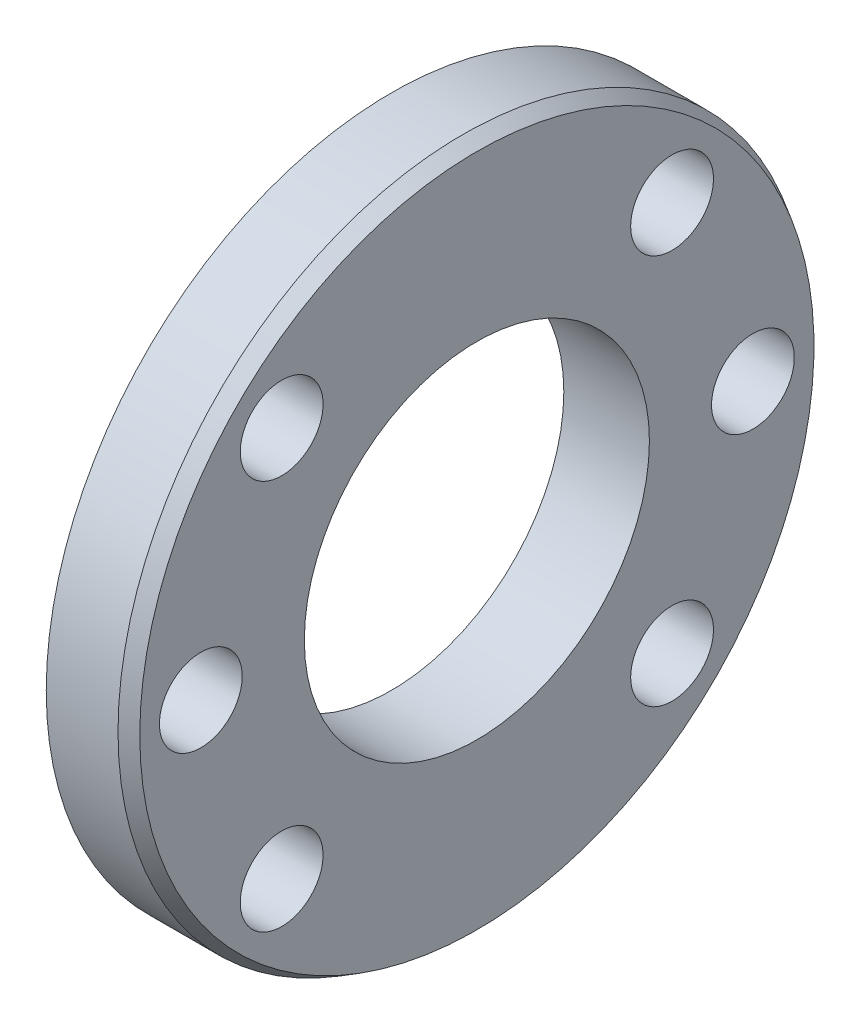
ISO-10303-21;
HEADER;
FILE_DESCRIPTION(('STEP AP214'),'2;1');
FILE_NAME('part.step','',(''),(''),'','','');
FILE_SCHEMA(('AUTOMOTIVE_DESIGN { 1 0 10303 214 1 1 1 1 }'));
ENDSEC;
DATA;
#1=APPLICATION_CONTEXT('core data for automotive mechanical design processes');
#2=APPLICATION_PROTOCOL_DEFINITION('international standard','automotive_design',2000,#1);
#3=PRODUCT_CONTEXT('',#1,'mechanical');
#4=PRODUCT('Part','Part','',(#3));
#5=PRODUCT_RELATED_PRODUCT_CATEGORY('part','',(#4));
#6=PRODUCT_DEFINITION_FORMATION('','',#4);
#7=PRODUCT_DEFINITION_CONTEXT('part definition',#1,'design');
#8=PRODUCT_DEFINITION('design','',#6,#7);
#9=PRODUCT_DEFINITION_SHAPE('','',#8);
#10=(LENGTH_UNIT() NAMED_UNIT(*) SI_UNIT(.MILLI.,.METRE.));
#11=(NAMED_UNIT(*) PLANE_ANGLE_UNIT() SI_UNIT($,.RADIAN.));
#12=(NAMED_UNIT(*) SI_UNIT($,.STERADIAN.) SOLID_ANGLE_UNIT());
#13=UNCERTAINTY_MEASURE_WITH_UNIT(LENGTH_MEASURE(1.E-05),#10,'distance_accuracy_value','');
#14=(GEOMETRIC_REPRESENTATION_CONTEXT(3) GLOBAL_UNCERTAINTY_ASSIGNED_CONTEXT((#13)) GLOBAL_UNIT_ASSIGNED_CONTEXT((#10,
#11,#12)) REPRESENTATION_CONTEXT('',''));
#15=CARTESIAN_POINT('',(0.,0.,0.));
#16=DIRECTION('',(0.,0.,1.));
#17=DIRECTION('',(1.,0.,0.));
#18=AXIS2_PLACEMENT_3D('',#15,#16,#17);
#19=CARTESIAN_POINT('',(1045.,0.,1320.));
#20=DIRECTION('',(-1.,0.,0.));
#21=DIRECTION('',(0.,0.,-1.));
#22=AXIS2_PLACEMENT_3D('',#19,#20,#21);
#23=CYLINDRICAL_SURFACE('',#22,12.5);
#24=CARTESIAN_POINT('',(1038.8,0.,1320.));
#25=DIRECTION('',(1.,0.,0.));
#26=DIRECTION('',(0.,0.,1.));
#27=AXIS2_PLACEMENT_3D('',#24,#25,#26);
#28=CIRCLE('',#27,12.5);
#29=CARTESIAN_POINT('',(1038.8,0.,1332.5));
#30=VERTEX_POINT('',#29);
#31=EDGE_CURVE('E22',#30,#30,#28,.T.);
#32=ORIENTED_EDGE('',*,*,#31,.F.);
#33=EDGE_LOOP('',(#32));
#34=FACE_BOUND('',#33,.T.);
#35=CARTESIAN_POINT('',(1045.,0.,1320.));
#36=DIRECTION('',(-1.,0.,0.));
#37=DIRECTION('',(0.,0.,-1.));
#38=AXIS2_PLACEMENT_3D('',#35,#36,#37);
#39=CIRCLE('',#38,12.5);
#40=CARTESIAN_POINT('',(1045.,0.,1307.5));
#41=VERTEX_POINT('',#40);
#42=EDGE_CURVE('E36',#41,#41,#39,.T.);
#43=ORIENTED_EDGE('',*,*,#42,.F.);
#44=EDGE_LOOP('',(#43));
#45=FACE_BOUND('',#44,.T.);
#46=ADVANCED_FACE('F14',(#34,#45),#23,.F.);
#47=CARTESIAN_POINT('',(1045.,0.,1340.));
#48=DIRECTION('',(-1.,0.,0.));
#49=DIRECTION('',(0.,0.,-1.));
#50=AXIS2_PLACEMENT_3D('',#47,#48,#49);
#51=CYLINDRICAL_SURFACE('',#50,3.);
#52=CARTESIAN_POINT('',(1038.8,0.,1340.));
#53=DIRECTION('',(1.,0.,0.));
#54=DIRECTION('',(0.,0.,1.));
#55=AXIS2_PLACEMENT_3D('',#52,#53,#54);
#56=CIRCLE('',#55,3.);
#57=CARTESIAN_POINT('',(1038.8,0.,1343.));
#58=VERTEX_POINT('',#57);
#59=EDGE_CURVE('E27',#58,#58,#56,.T.);
#60=ORIENTED_EDGE('',*,*,#59,.F.);
#61=EDGE_LOOP('',(#60));
#62=FACE_BOUND('',#61,.T.);
#63=CARTESIAN_POINT('',(1045.,0.,1340.));
#64=DIRECTION('',(-1.,0.,0.));
#65=DIRECTION('',(0.,0.,-1.));
#66=AXIS2_PLACEMENT_3D('',#63,#64,#65);
#67=CIRCLE('',#66,3.);
#68=CARTESIAN_POINT('',(1045.,0.,1337.));
#69=VERTEX_POINT('',#68);
#70=EDGE_CURVE('E33',#69,#69,#67,.T.);
#71=ORIENTED_EDGE('',*,*,#70,.F.);
#72=EDGE_LOOP('',(#71));
#73=FACE_BOUND('',#72,.T.);
#74=ADVANCED_FACE('F98',(#62,#73),#51,.F.);
#75=CARTESIAN_POINT('',(1045.,0.,1320.));
#76=DIRECTION('',(1.,0.,0.));
#77=DIRECTION('',(0.,0.,1.));
#78=AXIS2_PLACEMENT_3D('',#75,#76,#77);
#79=PLANE('',#78);
#80=CARTESIAN_POINT('',(1045.,-14.1421356237309,1305.85786437627));
#81=DIRECTION('',(-1.,0.,0.));
#82=DIRECTION('',(0.,0.,1.));
#83=AXIS2_PLACEMENT_3D('',#80,#81,#82);
#84=CIRCLE('',#83,3.);
#85=CARTESIAN_POINT('',(1045.,-14.1421356237309,1308.85786437627));
#86=VERTEX_POINT('',#85);
#87=EDGE_CURVE('E69',#86,#86,#84,.T.);
#88=ORIENTED_EDGE('',*,*,#87,.T.);
#89=EDGE_LOOP('',(#88));
#90=FACE_BOUND('',#89,.T.);
#91=CARTESIAN_POINT('',(1045.,0.,1300.));
#92=DIRECTION('',(-1.,0.,0.));
#93=DIRECTION('',(0.,0.,1.));
#94=AXIS2_PLACEMENT_3D('',#91,#92,#93);
#95=CIRCLE('',#94,3.);
#96=CARTESIAN_POINT('',(1045.,0.,1303.));
#97=VERTEX_POINT('',#96);
#98=EDGE_CURVE('E59',#97,#97,#95,.T.);
#99=ORIENTED_EDGE('',*,*,#98,.T.);
#100=EDGE_LOOP('',(#99));
#101=FACE_BOUND('',#100,.T.);
#102=CARTESIAN_POINT('',(1045.,14.1421356237309,1305.85786437627));
#103=DIRECTION('',(-1.,0.,0.));
#104=DIRECTION('',(0.,0.,1.));
#105=AXIS2_PLACEMENT_3D('',#102,#103,#104);
#106=CIRCLE('',#105,3.);
#107=CARTESIAN_POINT('',(1045.,14.1421356237309,1308.85786437627));
#108=VERTEX_POINT('',#107);
#109=EDGE_CURVE('E56',#108,#108,#106,.T.);
#110=ORIENTED_EDGE('',*,*,#109,.T.);
#111=EDGE_LOOP('',(#110));
#112=FACE_BOUND('',#111,.T.);
#113=CARTESIAN_POINT('',(1045.,14.1421356237309,1334.14213562373));
#114=DIRECTION('',(-1.,0.,0.));
#115=DIRECTION('',(0.,0.,1.));
#116=AXIS2_PLACEMENT_3D('',#113,#114,#115);
#117=CIRCLE('',#116,3.);
#118=CARTESIAN_POINT('',(1045.,14.1421356237309,1337.14213562373));
#119=VERTEX_POINT('',#118);
#120=EDGE_CURVE('E53',#119,#119,#117,.T.);
#121=ORIENTED_EDGE('',*,*,#120,.T.);
#122=EDGE_LOOP('',(#121));
#123=FACE_BOUND('',#122,.T.);
#124=CARTESIAN_POINT('',(1045.,-14.1421356237309,1334.14213562373));
#125=DIRECTION('',(-1.,0.,0.));
#126=DIRECTION('',(0.,0.,1.));
#127=AXIS2_PLACEMENT_3D('',#124,#125,#126);
#128=CIRCLE('',#127,3.);
#129=CARTESIAN_POINT('',(1045.,-14.1421356237309,1337.14213562373));
#130=VERTEX_POINT('',#129);
#131=EDGE_CURVE('E31',#130,#130,#128,.T.);
#132=ORIENTED_EDGE('',*,*,#131,.T.);
#133=EDGE_LOOP('',(#132));
#134=FACE_BOUND('',#133,.T.);
#135=CARTESIAN_POINT('',(1045.,0.,1320.));
#136=DIRECTION('',(1.,0.,0.));
#137=DIRECTION('',(0.,0.,1.));
#138=AXIS2_PLACEMENT_3D('',#135,#136,#137);
#139=CIRCLE('',#138,24.4226497308104);
#140=CARTESIAN_POINT('',(1045.,0.,1344.42264973081));
#141=VERTEX_POINT('',#140);
#142=EDGE_CURVE('E40',#141,#141,#139,.T.);
#143=ORIENTED_EDGE('',*,*,#142,.T.);
#144=EDGE_LOOP('',(#143));
#145=FACE_BOUND('',#144,.T.);
#146=ORIENTED_EDGE('',*,*,#70,.T.);
#147=EDGE_LOOP('',(#146));
#148=FACE_BOUND('',#147,.T.);
#149=ORIENTED_EDGE('',*,*,#42,.T.);
#150=EDGE_LOOP('',(#149));
#151=FACE_BOUND('',#150,.T.);
#152=ADVANCED_FACE('F74',(#90,#101,#112,#123,#134,#145,#148,#151),#79,.T.);
#153=CARTESIAN_POINT('',(1045.,0.,1320.));
#154=DIRECTION('',(-1.,0.,0.));
#155=DIRECTION('',(0.,0.,-1.));
#156=AXIS2_PLACEMENT_3D('',#153,#154,#155);
#157=CONICAL_SURFACE('',#156,24.4226497308104,0.523598775598299);
#158=CARTESIAN_POINT('',(1044.,0.,1320.));
#159=DIRECTION('',(1.,0.,0.));
#160=DIRECTION('',(0.,0.,1.));
#161=AXIS2_PLACEMENT_3D('',#158,#159,#160);
#162=CIRCLE('',#161,25.);
#163=CARTESIAN_POINT('',(1044.,0.,1345.));
#164=VERTEX_POINT('',#163);
#165=EDGE_CURVE('E43',#164,#164,#162,.F.);
#166=ORIENTED_EDGE('',*,*,#165,.F.);
#167=EDGE_LOOP('',(#166));
#168=FACE_BOUND('',#167,.T.);
#169=ORIENTED_EDGE('',*,*,#142,.F.);
#170=EDGE_LOOP('',(#169));
#171=FACE_BOUND('',#170,.T.);
#172=ADVANCED_FACE('F103',(#168,#171),#157,.T.);
#173=CARTESIAN_POINT('',(1031.3,0.,1320.));
#174=DIRECTION('',(1.,0.,0.));
#175=DIRECTION('',(0.,0.,1.));
#176=AXIS2_PLACEMENT_3D('',#173,#174,#175);
#177=CYLINDRICAL_SURFACE('',#176,25.);
#178=CARTESIAN_POINT('',(1038.8,0.,1320.));
#179=DIRECTION('',(1.,0.,0.));
#180=DIRECTION('',(0.,0.,-1.));
#181=AXIS2_PLACEMENT_3D('',#178,#179,#180);
#182=CIRCLE('',#181,25.);
#183=CARTESIAN_POINT('',(1038.8,0.,1295.));
#184=VERTEX_POINT('',#183);
#185=EDGE_CURVE('E10',#184,#184,#182,.F.);
#186=ORIENTED_EDGE('',*,*,#185,.F.);
#187=EDGE_LOOP('',(#186));
#188=FACE_BOUND('',#187,.T.);
#189=ORIENTED_EDGE('',*,*,#165,.T.);
#190=EDGE_LOOP('',(#189));
#191=FACE_BOUND('',#190,.T.);
#192=ADVANCED_FACE('F16',(#188,#191),#177,.T.);
#193=CARTESIAN_POINT('',(1038.8,0.,1320.));
#194=DIRECTION('',(1.,0.,0.));
#195=DIRECTION('',(0.,0.,-1.));
#196=AXIS2_PLACEMENT_3D('',#193,#194,#195);
#197=PLANE('',#196);
#198=CARTESIAN_POINT('',(1038.8,-14.1421356237309,1305.85786437627));
#199=DIRECTION('',(1.,0.,0.));
#200=DIRECTION('',(0.,0.,-1.));
#201=AXIS2_PLACEMENT_3D('',#198,#199,#200);
#202=CIRCLE('',#201,3.);
#203=CARTESIAN_POINT('',(1038.8,-14.1421356237309,1302.85786437627));
#204=VERTEX_POINT('',#203);
#205=EDGE_CURVE('E18',#204,#204,#202,.T.);
#206=ORIENTED_EDGE('',*,*,#205,.T.);
#207=EDGE_LOOP('',(#206));
#208=FACE_BOUND('',#207,.T.);
#209=CARTESIAN_POINT('',(1038.8,0.,1300.));
#210=DIRECTION('',(1.,0.,0.));
#211=DIRECTION('',(0.,0.,-1.));
#212=AXIS2_PLACEMENT_3D('',#209,#210,#211);
#213=CIRCLE('',#212,3.);
#214=CARTESIAN_POINT('',(1038.8,0.,1297.));
#215=VERTEX_POINT('',#214);
#216=EDGE_CURVE('E57',#215,#215,#213,.T.);
#217=ORIENTED_EDGE('',*,*,#216,.T.);
#218=EDGE_LOOP('',(#217));
#219=FACE_BOUND('',#218,.T.);
#220=CARTESIAN_POINT('',(1038.8,14.1421356237309,1305.85786437627));
#221=DIRECTION('',(1.,0.,0.));
#222=DIRECTION('',(0.,0.,-1.));
#223=AXIS2_PLACEMENT_3D('',#220,#221,#222);
#224=CIRCLE('',#223,3.);
#225=CARTESIAN_POINT('',(1038.8,14.1421356237309,1302.85786437627));
#226=VERTEX_POINT('',#225);
#227=EDGE_CURVE('E54',#226,#226,#224,.T.);
#228=ORIENTED_EDGE('',*,*,#227,.T.);
#229=EDGE_LOOP('',(#228));
#230=FACE_BOUND('',#229,.T.);
#231=CARTESIAN_POINT('',(1038.8,14.1421356237309,1334.14213562373));
#232=DIRECTION('',(1.,0.,0.));
#233=DIRECTION('',(0.,0.,-1.));
#234=AXIS2_PLACEMENT_3D('',#231,#232,#233);
#235=CIRCLE('',#234,3.);
#236=CARTESIAN_POINT('',(1038.8,14.1421356237309,1331.14213562373));
#237=VERTEX_POINT('',#236);
#238=EDGE_CURVE('E50',#237,#237,#235,.T.);
#239=ORIENTED_EDGE('',*,*,#238,.T.);
#240=EDGE_LOOP('',(#239));
#241=FACE_BOUND('',#240,.T.);
#242=CARTESIAN_POINT('',(1038.8,-14.1421356237309,1334.14213562373));
#243=DIRECTION('',(1.,0.,0.));
#244=DIRECTION('',(0.,0.,-1.));
#245=AXIS2_PLACEMENT_3D('',#242,#243,#244);
#246=CIRCLE('',#245,3.);
#247=CARTESIAN_POINT('',(1038.8,-14.1421356237309,1331.14213562373));
#248=VERTEX_POINT('',#247);
#249=EDGE_CURVE('E37',#248,#248,#246,.T.);
#250=ORIENTED_EDGE('',*,*,#249,.T.);
#251=EDGE_LOOP('',(#250));
#252=FACE_BOUND('',#251,.T.);
#253=ORIENTED_EDGE('',*,*,#185,.T.);
#254=EDGE_LOOP('',(#253));
#255=FACE_BOUND('',#254,.T.);
#256=ORIENTED_EDGE('',*,*,#59,.T.);
#257=EDGE_LOOP('',(#256));
#258=FACE_BOUND('',#257,.T.);
#259=ORIENTED_EDGE('',*,*,#31,.T.);
#260=EDGE_LOOP('',(#259));
#261=FACE_BOUND('',#260,.T.);
#262=ADVANCED_FACE('F85',(#208,#219,#230,#241,#252,#255,#258,#261),#197,.F.);
#263=CARTESIAN_POINT('',(1045.,-14.1421356237309,1334.14213562373));
#264=DIRECTION('',(-1.,0.,0.));
#265=DIRECTION('',(0.,0.,1.));
#266=AXIS2_PLACEMENT_3D('',#263,#264,#265);
#267=CYLINDRICAL_SURFACE('',#266,3.);
#268=ORIENTED_EDGE('',*,*,#131,.F.);
#269=EDGE_LOOP('',(#268));
#270=FACE_BOUND('',#269,.T.);
#271=ORIENTED_EDGE('',*,*,#249,.F.);
#272=EDGE_LOOP('',(#271));
#273=FACE_BOUND('',#272,.T.);
#274=ADVANCED_FACE('F81',(#270,#273),#267,.F.);
#275=CARTESIAN_POINT('',(1045.,14.1421356237309,1334.14213562373));
#276=DIRECTION('',(-1.,0.,0.));
#277=DIRECTION('',(0.,0.,1.));
#278=AXIS2_PLACEMENT_3D('',#275,#276,#277);
#279=CYLINDRICAL_SURFACE('',#278,3.);
#280=ORIENTED_EDGE('',*,*,#120,.F.);
#281=EDGE_LOOP('',(#280));
#282=FACE_BOUND('',#281,.T.);
#283=ORIENTED_EDGE('',*,*,#238,.F.);
#284=EDGE_LOOP('',(#283));
#285=FACE_BOUND('',#284,.T.);
#286=ADVANCED_FACE('F77',(#282,#285),#279,.F.);
#287=CARTESIAN_POINT('',(1045.,14.1421356237309,1305.85786437627));
#288=DIRECTION('',(-1.,0.,0.));
#289=DIRECTION('',(0.,0.,1.));
#290=AXIS2_PLACEMENT_3D('',#287,#288,#289);
#291=CYLINDRICAL_SURFACE('',#290,3.);
#292=ORIENTED_EDGE('',*,*,#109,.F.);
#293=EDGE_LOOP('',(#292));
#294=FACE_BOUND('',#293,.T.);
#295=ORIENTED_EDGE('',*,*,#227,.F.);
#296=EDGE_LOOP('',(#295));
#297=FACE_BOUND('',#296,.T.);
#298=ADVANCED_FACE('F80',(#294,#297),#291,.F.);
#299=CARTESIAN_POINT('',(1045.,0.,1300.));
#300=DIRECTION('',(-1.,0.,0.));
#301=DIRECTION('',(0.,0.,1.));
#302=AXIS2_PLACEMENT_3D('',#299,#300,#301);
#303=CYLINDRICAL_SURFACE('',#302,3.);
#304=ORIENTED_EDGE('',*,*,#98,.F.);
#305=EDGE_LOOP('',(#304));
#306=FACE_BOUND('',#305,.T.);
#307=ORIENTED_EDGE('',*,*,#216,.F.);
#308=EDGE_LOOP('',(#307));
#309=FACE_BOUND('',#308,.T.);
#310=ADVANCED_FACE('F121',(#306,#309),#303,.F.);
#311=CARTESIAN_POINT('',(1045.,-14.1421356237309,1305.85786437627));
#312=DIRECTION('',(-1.,0.,0.));
#313=DIRECTION('',(0.,0.,1.));
#314=AXIS2_PLACEMENT_3D('',#311,#312,#313);
#315=CYLINDRICAL_SURFACE('',#314,3.);
#316=ORIENTED_EDGE('',*,*,#87,.F.);
#317=EDGE_LOOP('',(#316));
#318=FACE_BOUND('',#317,.T.);
#319=ORIENTED_EDGE('',*,*,#205,.F.);
#320=EDGE_LOOP('',(#319));
#321=FACE_BOUND('',#320,.T.);
#322=ADVANCED_FACE('F125',(#318,#321),#315,.F.);
#323=CLOSED_SHELL('',(#46,#74,#152,#172,#192,#262,#274,#286,#298,#310,#322));
#324=MANIFOLD_SOLID_BREP('B1',#323);
#325=ADVANCED_BREP_SHAPE_REPRESENTATION('',(#18,#324),#14);
#326=SHAPE_DEFINITION_REPRESENTATION(#9,#325);
ENDSEC;
END-ISO-10303-21;
